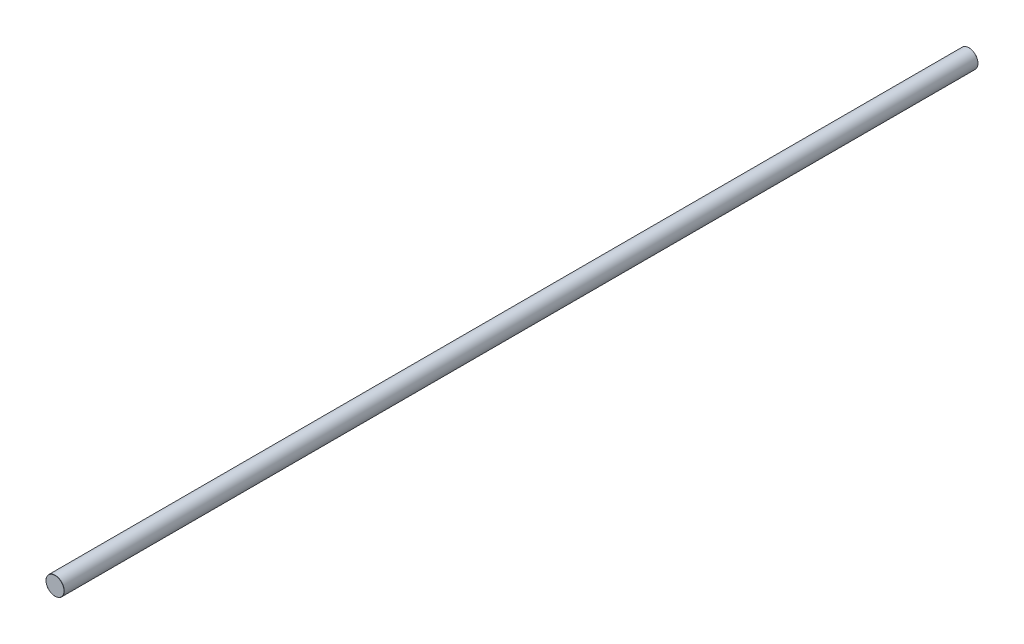
ISO-10303-21;
HEADER;
FILE_DESCRIPTION(('STEP AP214'),'2;1');
FILE_NAME('part.step','',(''),(''),'','','');
FILE_SCHEMA(('AUTOMOTIVE_DESIGN { 1 0 10303 214 1 1 1 1 }'));
ENDSEC;
DATA;
#1=APPLICATION_CONTEXT('core data for automotive mechanical design processes');
#2=APPLICATION_PROTOCOL_DEFINITION('international standard','automotive_design',2000,#1);
#3=PRODUCT_CONTEXT('',#1,'mechanical');
#4=PRODUCT('Part','Part','',(#3));
#5=PRODUCT_RELATED_PRODUCT_CATEGORY('part','',(#4));
#6=PRODUCT_DEFINITION_FORMATION('','',#4);
#7=PRODUCT_DEFINITION_CONTEXT('part definition',#1,'design');
#8=PRODUCT_DEFINITION('design','',#6,#7);
#9=PRODUCT_DEFINITION_SHAPE('','',#8);
#10=(LENGTH_UNIT() NAMED_UNIT(*) SI_UNIT(.MILLI.,.METRE.));
#11=(NAMED_UNIT(*) PLANE_ANGLE_UNIT() SI_UNIT($,.RADIAN.));
#12=(NAMED_UNIT(*) SI_UNIT($,.STERADIAN.) SOLID_ANGLE_UNIT());
#13=UNCERTAINTY_MEASURE_WITH_UNIT(LENGTH_MEASURE(1.E-05),#10,'distance_accuracy_value','');
#14=(GEOMETRIC_REPRESENTATION_CONTEXT(3) GLOBAL_UNCERTAINTY_ASSIGNED_CONTEXT((#13)) GLOBAL_UNIT_ASSIGNED_CONTEXT((#10,
#11,#12)) REPRESENTATION_CONTEXT('',''));
#15=CARTESIAN_POINT('',(0.,0.,0.));
#16=DIRECTION('',(0.,0.,1.));
#17=DIRECTION('',(1.,0.,0.));
#18=AXIS2_PLACEMENT_3D('',#15,#16,#17);
#19=CARTESIAN_POINT('',(0.,0.,500.));
#20=DIRECTION('',(0.,0.,-1.));
#21=DIRECTION('',(-1.,0.,0.));
#22=AXIS2_PLACEMENT_3D('',#19,#20,#21);
#23=CYLINDRICAL_SURFACE('',#22,5.);
#24=CARTESIAN_POINT('',(0.,0.,0.099999999999989));
#25=DIRECTION('',(0.,0.,1.));
#26=DIRECTION('',(1.,0.,0.));
#27=AXIS2_PLACEMENT_3D('',#24,#25,#26);
#28=CIRCLE('',#27,5.);
#29=CARTESIAN_POINT('',(5.,0.,0.099999999999989));
#30=VERTEX_POINT('',#29);
#31=EDGE_CURVE('E50',#30,#30,#28,.T.);
#32=ORIENTED_EDGE('',*,*,#31,.T.);
#33=EDGE_LOOP('',(#32));
#34=FACE_BOUND('',#33,.T.);
#35=CARTESIAN_POINT('',(0.,0.,499.9));
#36=DIRECTION('',(0.,0.,1.));
#37=DIRECTION('',(1.,0.,0.));
#38=AXIS2_PLACEMENT_3D('',#35,#36,#37);
#39=CIRCLE('',#38,5.);
#40=CARTESIAN_POINT('',(5.,0.,499.9));
#41=VERTEX_POINT('',#40);
#42=EDGE_CURVE('E55',#41,#41,#39,.F.);
#43=ORIENTED_EDGE('',*,*,#42,.T.);
#44=EDGE_LOOP('',(#43));
#45=FACE_BOUND('',#44,.T.);
#46=ADVANCED_FACE('F37',(#34,#45),#23,.T.);
#47=CARTESIAN_POINT('',(0.,0.,500.));
#48=DIRECTION('',(0.,0.,1.));
#49=DIRECTION('',(1.,0.,0.));
#50=AXIS2_PLACEMENT_3D('',#47,#48,#49);
#51=PLANE('',#50);
#52=CARTESIAN_POINT('',(0.,0.,500.));
#53=DIRECTION('',(0.,0.,1.));
#54=DIRECTION('',(1.,0.,0.));
#55=AXIS2_PLACEMENT_3D('',#52,#53,#54);
#56=CIRCLE('',#55,4.9);
#57=CARTESIAN_POINT('',(4.9,0.,500.));
#58=VERTEX_POINT('',#57);
#59=EDGE_CURVE('E10',#58,#58,#56,.T.);
#60=ORIENTED_EDGE('',*,*,#59,.T.);
#61=EDGE_LOOP('',(#60));
#62=FACE_BOUND('',#61,.T.);
#63=ADVANCED_FACE('F72',(#62),#51,.T.);
#64=CARTESIAN_POINT('',(0.,0.,0.));
#65=DIRECTION('',(0.,0.,1.));
#66=DIRECTION('',(1.,0.,0.));
#67=AXIS2_PLACEMENT_3D('',#64,#65,#66);
#68=PLANE('',#67);
#69=CARTESIAN_POINT('',(0.,0.,0.));
#70=DIRECTION('',(0.,0.,1.));
#71=DIRECTION('',(1.,0.,0.));
#72=AXIS2_PLACEMENT_3D('',#69,#70,#71);
#73=CIRCLE('',#72,4.9);
#74=CARTESIAN_POINT('',(4.9,0.,0.));
#75=VERTEX_POINT('',#74);
#76=EDGE_CURVE('E45',#75,#75,#73,.F.);
#77=ORIENTED_EDGE('',*,*,#76,.T.);
#78=EDGE_LOOP('',(#77));
#79=FACE_BOUND('',#78,.T.);
#80=ADVANCED_FACE('F69',(#79),#68,.F.);
#81=CARTESIAN_POINT('',(0.,0.,0.099999999999989));
#82=DIRECTION('',(0.,0.,1.));
#83=DIRECTION('',(1.,0.,0.));
#84=AXIS2_PLACEMENT_3D('',#81,#82,#83);
#85=TOROIDAL_SURFACE('',#84,4.9,0.1);
#86=ORIENTED_EDGE('',*,*,#76,.F.);
#87=EDGE_LOOP('',(#86));
#88=FACE_BOUND('',#87,.T.);
#89=ORIENTED_EDGE('',*,*,#31,.F.);
#90=EDGE_LOOP('',(#89));
#91=FACE_BOUND('',#90,.T.);
#92=ADVANCED_FACE('F65',(#88,#91),#85,.T.);
#93=CARTESIAN_POINT('',(0.,0.,499.9));
#94=DIRECTION('',(0.,0.,1.));
#95=DIRECTION('',(1.,0.,0.));
#96=AXIS2_PLACEMENT_3D('',#93,#94,#95);
#97=TOROIDAL_SURFACE('',#96,4.9,0.1);
#98=ORIENTED_EDGE('',*,*,#42,.F.);
#99=EDGE_LOOP('',(#98));
#100=FACE_BOUND('',#99,.T.);
#101=ORIENTED_EDGE('',*,*,#59,.F.);
#102=EDGE_LOOP('',(#101));
#103=FACE_BOUND('',#102,.T.);
#104=ADVANCED_FACE('F39',(#100,#103),#97,.T.);
#105=CLOSED_SHELL('',(#46,#63,#80,#92,#104));
#106=MANIFOLD_SOLID_BREP('B2',#105);
#107=ADVANCED_BREP_SHAPE_REPRESENTATION('',(#18,#106),#14);
#108=SHAPE_DEFINITION_REPRESENTATION(#9,#107);
ENDSEC;
END-ISO-10303-21;
